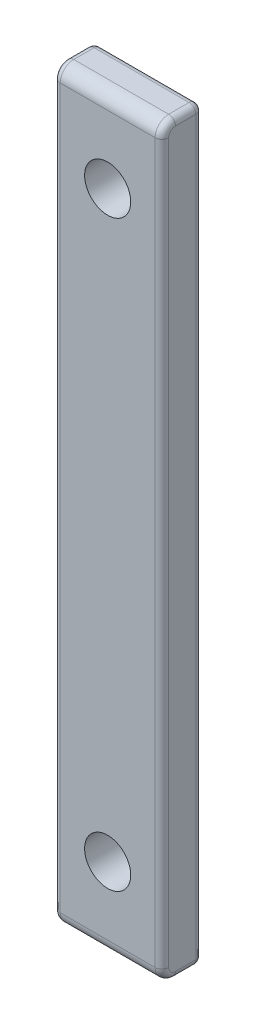
ISO-10303-21;
HEADER;
FILE_DESCRIPTION(('STEP AP214'),'2;1');
FILE_NAME('part.step','',(''),(''),'','','');
FILE_SCHEMA(('AUTOMOTIVE_DESIGN { 1 0 10303 214 1 1 1 1 }'));
ENDSEC;
DATA;
#1=APPLICATION_CONTEXT('core data for automotive mechanical design processes');
#2=APPLICATION_PROTOCOL_DEFINITION('international standard','automotive_design',2000,#1);
#3=PRODUCT_CONTEXT('',#1,'mechanical');
#4=PRODUCT('Part','Part','',(#3));
#5=PRODUCT_RELATED_PRODUCT_CATEGORY('part','',(#4));
#6=PRODUCT_DEFINITION_FORMATION('','',#4);
#7=PRODUCT_DEFINITION_CONTEXT('part definition',#1,'design');
#8=PRODUCT_DEFINITION('design','',#6,#7);
#9=PRODUCT_DEFINITION_SHAPE('','',#8);
#10=(LENGTH_UNIT() NAMED_UNIT(*) SI_UNIT(.MILLI.,.METRE.));
#11=(NAMED_UNIT(*) PLANE_ANGLE_UNIT() SI_UNIT($,.RADIAN.));
#12=(NAMED_UNIT(*) SI_UNIT($,.STERADIAN.) SOLID_ANGLE_UNIT());
#13=UNCERTAINTY_MEASURE_WITH_UNIT(LENGTH_MEASURE(1.E-05),#10,'distance_accuracy_value','');
#14=(GEOMETRIC_REPRESENTATION_CONTEXT(3) GLOBAL_UNCERTAINTY_ASSIGNED_CONTEXT((#13)) GLOBAL_UNIT_ASSIGNED_CONTEXT((#10,
#11,#12)) REPRESENTATION_CONTEXT('',''));
#15=CARTESIAN_POINT('',(0.,0.,0.));
#16=DIRECTION('',(0.,0.,1.));
#17=DIRECTION('',(1.,0.,0.));
#18=AXIS2_PLACEMENT_3D('',#15,#16,#17);
#19=CARTESIAN_POINT('',(-4.,-27.5,3.));
#20=DIRECTION('',(0.,1.,0.));
#21=DIRECTION('',(-1.,0.,0.));
#22=AXIS2_PLACEMENT_3D('',#19,#20,#21);
#23=PLANE('',#22);
#24=DIRECTION('',(0.,0.,-1.));
#25=VECTOR('',#24,1.);
#26=CARTESIAN_POINT('',(-3.5,-27.5,3.));
#27=LINE('',#26,#25);
#28=CARTESIAN_POINT('',(-3.5,-27.5,2.));
#29=VERTEX_POINT('',#28);
#30=CARTESIAN_POINT('',(-3.5,-27.5,0.5));
#31=VERTEX_POINT('',#30);
#32=EDGE_CURVE('E193',#29,#31,#27,.T.);
#33=ORIENTED_EDGE('',*,*,#32,.T.);
#34=DIRECTION('',(1.,0.,0.));
#35=VECTOR('',#34,1.);
#36=CARTESIAN_POINT('',(3.5,-27.5,0.5));
#37=LINE('',#36,#35);
#38=CARTESIAN_POINT('',(3.5,-27.5,0.5));
#39=VERTEX_POINT('',#38);
#40=EDGE_CURVE('E286',#31,#39,#37,.T.);
#41=ORIENTED_EDGE('',*,*,#40,.T.);
#42=DIRECTION('',(0.,0.,-1.));
#43=VECTOR('',#42,1.);
#44=CARTESIAN_POINT('',(3.5,-27.5,3.));
#45=LINE('',#44,#43);
#46=CARTESIAN_POINT('',(3.5,-27.5,2.));
#47=VERTEX_POINT('',#46);
#48=EDGE_CURVE('E197',#39,#47,#45,.F.);
#49=ORIENTED_EDGE('',*,*,#48,.T.);
#50=DIRECTION('',(1.,0.,0.));
#51=VECTOR('',#50,1.);
#52=CARTESIAN_POINT('',(-4.,-27.5,2.));
#53=LINE('',#52,#51);
#54=EDGE_CURVE('E181',#47,#29,#53,.F.);
#55=ORIENTED_EDGE('',*,*,#54,.T.);
#56=EDGE_LOOP('',(#33,#41,#49,#55));
#57=FACE_BOUND('',#56,.T.);
#58=ADVANCED_FACE('F46',(#57),#23,.F.);
#59=CARTESIAN_POINT('',(4.,27.5,3.));
#60=DIRECTION('',(-1.,0.,0.));
#61=DIRECTION('',(0.,-1.,0.));
#62=AXIS2_PLACEMENT_3D('',#59,#60,#61);
#63=PLANE('',#62);
#64=DIRECTION('',(0.,0.,-1.));
#65=VECTOR('',#64,1.);
#66=CARTESIAN_POINT('',(4.,-27.,3.));
#67=LINE('',#66,#65);
#68=CARTESIAN_POINT('',(4.,-27.,2.));
#69=VERTEX_POINT('',#68);
#70=CARTESIAN_POINT('',(4.,-27.,0.5));
#71=VERTEX_POINT('',#70);
#72=EDGE_CURVE('E190',#69,#71,#67,.T.);
#73=ORIENTED_EDGE('',*,*,#72,.T.);
#74=DIRECTION('',(0.,1.,0.));
#75=VECTOR('',#74,1.);
#76=CARTESIAN_POINT('',(4.,27.,0.5));
#77=LINE('',#76,#75);
#78=CARTESIAN_POINT('',(4.,27.,0.5));
#79=VERTEX_POINT('',#78);
#80=EDGE_CURVE('E267',#71,#79,#77,.T.);
#81=ORIENTED_EDGE('',*,*,#80,.T.);
#82=DIRECTION('',(0.,0.,-1.));
#83=VECTOR('',#82,1.);
#84=CARTESIAN_POINT('',(4.,27.,3.));
#85=LINE('',#84,#83);
#86=CARTESIAN_POINT('',(4.,27.,2.));
#87=VERTEX_POINT('',#86);
#88=EDGE_CURVE('E156',#79,#87,#85,.F.);
#89=ORIENTED_EDGE('',*,*,#88,.T.);
#90=CARTESIAN_POINT('',(4.,26.5,2.));
#91=DIRECTION('',(-1.,0.,0.));
#92=DIRECTION('',(0.,-1.,0.));
#93=AXIS2_PLACEMENT_3D('',#90,#91,#92);
#94=CIRCLE('',#93,0.5);
#95=CARTESIAN_POINT('',(4.,26.5,2.5));
#96=VERTEX_POINT('',#95);
#97=EDGE_CURVE('E148',#87,#96,#94,.F.);
#98=ORIENTED_EDGE('',*,*,#97,.T.);
#99=DIRECTION('',(0.,1.,0.));
#100=VECTOR('',#99,1.);
#101=CARTESIAN_POINT('',(4.,27.5,2.5));
#102=LINE('',#101,#100);
#103=CARTESIAN_POINT('',(4.,-26.5,2.5));
#104=VERTEX_POINT('',#103);
#105=EDGE_CURVE('E153',#96,#104,#102,.F.);
#106=ORIENTED_EDGE('',*,*,#105,.T.);
#107=CARTESIAN_POINT('',(4.,-26.5,2.));
#108=DIRECTION('',(-1.,0.,0.));
#109=DIRECTION('',(0.,-1.,0.));
#110=AXIS2_PLACEMENT_3D('',#107,#108,#109);
#111=CIRCLE('',#110,0.5);
#112=EDGE_CURVE('E187',#104,#69,#111,.F.);
#113=ORIENTED_EDGE('',*,*,#112,.T.);
#114=EDGE_LOOP('',(#73,#81,#89,#98,#106,#113));
#115=FACE_BOUND('',#114,.T.);
#116=ADVANCED_FACE('F151',(#115),#63,.F.);
#117=CARTESIAN_POINT('',(-4.,27.5,3.));
#118=DIRECTION('',(0.,-1.,0.));
#119=DIRECTION('',(0.,0.,-1.));
#120=AXIS2_PLACEMENT_3D('',#117,#118,#119);
#121=PLANE('',#120);
#122=DIRECTION('',(0.,0.,-1.));
#123=VECTOR('',#122,1.);
#124=CARTESIAN_POINT('',(3.5,27.5,3.));
#125=LINE('',#124,#123);
#126=CARTESIAN_POINT('',(3.5,27.5,2.));
#127=VERTEX_POINT('',#126);
#128=CARTESIAN_POINT('',(3.5,27.5,0.5));
#129=VERTEX_POINT('',#128);
#130=EDGE_CURVE('E209',#127,#129,#125,.T.);
#131=ORIENTED_EDGE('',*,*,#130,.T.);
#132=DIRECTION('',(-1.,0.,0.));
#133=VECTOR('',#132,1.);
#134=CARTESIAN_POINT('',(-3.5,27.5,0.5));
#135=LINE('',#134,#133);
#136=CARTESIAN_POINT('',(-3.5,27.5,0.5));
#137=VERTEX_POINT('',#136);
#138=EDGE_CURVE('E11',#129,#137,#135,.T.);
#139=ORIENTED_EDGE('',*,*,#138,.T.);
#140=DIRECTION('',(0.,0.,-1.));
#141=VECTOR('',#140,1.);
#142=CARTESIAN_POINT('',(-3.5,27.5,3.));
#143=LINE('',#142,#141);
#144=CARTESIAN_POINT('',(-3.5,27.5,2.));
#145=VERTEX_POINT('',#144);
#146=EDGE_CURVE('E206',#137,#145,#143,.F.);
#147=ORIENTED_EDGE('',*,*,#146,.T.);
#148=DIRECTION('',(-1.,0.,0.));
#149=VECTOR('',#148,1.);
#150=CARTESIAN_POINT('',(-4.,27.5,2.));
#151=LINE('',#150,#149);
#152=EDGE_CURVE('E177',#145,#127,#151,.F.);
#153=ORIENTED_EDGE('',*,*,#152,.T.);
#154=EDGE_LOOP('',(#131,#139,#147,#153));
#155=FACE_BOUND('',#154,.T.);
#156=ADVANCED_FACE('F416',(#155),#121,.F.);
#157=CARTESIAN_POINT('',(-4.,27.5,3.));
#158=DIRECTION('',(1.,0.,0.));
#159=DIRECTION('',(0.,1.,0.));
#160=AXIS2_PLACEMENT_3D('',#157,#158,#159);
#161=PLANE('',#160);
#162=DIRECTION('',(0.,0.,-1.));
#163=VECTOR('',#162,1.);
#164=CARTESIAN_POINT('',(-4.,27.,3.));
#165=LINE('',#164,#163);
#166=CARTESIAN_POINT('',(-4.,27.,2.));
#167=VERTEX_POINT('',#166);
#168=CARTESIAN_POINT('',(-4.,27.,0.5));
#169=VERTEX_POINT('',#168);
#170=EDGE_CURVE('E229',#167,#169,#165,.T.);
#171=ORIENTED_EDGE('',*,*,#170,.T.);
#172=DIRECTION('',(0.,-1.,0.));
#173=VECTOR('',#172,1.);
#174=CARTESIAN_POINT('',(-4.,-27.,0.5));
#175=LINE('',#174,#173);
#176=CARTESIAN_POINT('',(-4.,-27.,0.5));
#177=VERTEX_POINT('',#176);
#178=EDGE_CURVE('E292',#169,#177,#175,.T.);
#179=ORIENTED_EDGE('',*,*,#178,.T.);
#180=DIRECTION('',(0.,0.,-1.));
#181=VECTOR('',#180,1.);
#182=CARTESIAN_POINT('',(-4.,-27.,3.));
#183=LINE('',#182,#181);
#184=CARTESIAN_POINT('',(-4.,-27.,2.));
#185=VERTEX_POINT('',#184);
#186=EDGE_CURVE('E223',#177,#185,#183,.F.);
#187=ORIENTED_EDGE('',*,*,#186,.T.);
#188=CARTESIAN_POINT('',(-4.,-26.5,2.));
#189=DIRECTION('',(1.,0.,0.));
#190=DIRECTION('',(0.,1.,0.));
#191=AXIS2_PLACEMENT_3D('',#188,#189,#190);
#192=CIRCLE('',#191,0.5);
#193=CARTESIAN_POINT('',(-4.,-26.5,2.5));
#194=VERTEX_POINT('',#193);
#195=EDGE_CURVE('E220',#185,#194,#192,.F.);
#196=ORIENTED_EDGE('',*,*,#195,.T.);
#197=DIRECTION('',(0.,-1.,0.));
#198=VECTOR('',#197,1.);
#199=CARTESIAN_POINT('',(-4.,27.5,2.5));
#200=LINE('',#199,#198);
#201=CARTESIAN_POINT('',(-4.,26.5,2.5));
#202=VERTEX_POINT('',#201);
#203=EDGE_CURVE('E217',#194,#202,#200,.F.);
#204=ORIENTED_EDGE('',*,*,#203,.T.);
#205=CARTESIAN_POINT('',(-4.,26.5,2.));
#206=DIRECTION('',(1.,0.,0.));
#207=DIRECTION('',(0.,1.,0.));
#208=AXIS2_PLACEMENT_3D('',#205,#206,#207);
#209=CIRCLE('',#208,0.5);
#210=EDGE_CURVE('E226',#202,#167,#209,.F.);
#211=ORIENTED_EDGE('',*,*,#210,.T.);
#212=EDGE_LOOP('',(#171,#179,#187,#196,#204,#211));
#213=FACE_BOUND('',#212,.T.);
#214=ADVANCED_FACE('F386',(#213),#161,.F.);
#215=CARTESIAN_POINT('',(0.,0.,3.));
#216=DIRECTION('',(0.,0.,-1.));
#217=DIRECTION('',(-1.,0.,0.));
#218=AXIS2_PLACEMENT_3D('',#215,#216,#217);
#219=PLANE('',#218);
#220=CARTESIAN_POINT('',(0.,21.5,3.));
#221=DIRECTION('',(0.,0.,1.));
#222=DIRECTION('',(1.,0.,0.));
#223=AXIS2_PLACEMENT_3D('',#220,#221,#222);
#224=CIRCLE('',#223,1.7);
#225=CARTESIAN_POINT('',(1.7,21.5,3.));
#226=VERTEX_POINT('',#225);
#227=EDGE_CURVE('E364',#226,#226,#224,.T.);
#228=ORIENTED_EDGE('',*,*,#227,.F.);
#229=EDGE_LOOP('',(#228));
#230=FACE_BOUND('',#229,.T.);
#231=CARTESIAN_POINT('',(0.,-21.5,3.));
#232=DIRECTION('',(0.,0.,1.));
#233=DIRECTION('',(-1.,0.,0.));
#234=AXIS2_PLACEMENT_3D('',#231,#232,#233);
#235=CIRCLE('',#234,1.7);
#236=CARTESIAN_POINT('',(-1.7,-21.5,3.));
#237=VERTEX_POINT('',#236);
#238=EDGE_CURVE('E360',#237,#237,#235,.T.);
#239=ORIENTED_EDGE('',*,*,#238,.F.);
#240=EDGE_LOOP('',(#239));
#241=FACE_BOUND('',#240,.T.);
#242=DIRECTION('',(1.,0.,0.));
#243=VECTOR('',#242,1.);
#244=CARTESIAN_POINT('',(0.,-26.5,3.));
#245=LINE('',#244,#243);
#246=CARTESIAN_POINT('',(-3.5,-26.5,3.));
#247=VERTEX_POINT('',#246);
#248=CARTESIAN_POINT('',(3.5,-26.5,3.));
#249=VERTEX_POINT('',#248);
#250=EDGE_CURVE('E347',#247,#249,#245,.T.);
#251=ORIENTED_EDGE('',*,*,#250,.T.);
#252=DIRECTION('',(0.,1.,0.));
#253=VECTOR('',#252,1.);
#254=CARTESIAN_POINT('',(3.5,0.,3.));
#255=LINE('',#254,#253);
#256=CARTESIAN_POINT('',(3.5,26.5,3.));
#257=VERTEX_POINT('',#256);
#258=EDGE_CURVE('E235',#249,#257,#255,.T.);
#259=ORIENTED_EDGE('',*,*,#258,.T.);
#260=DIRECTION('',(-1.,0.,0.));
#261=VECTOR('',#260,1.);
#262=CARTESIAN_POINT('',(0.,26.5,3.));
#263=LINE('',#262,#261);
#264=CARTESIAN_POINT('',(-3.5,26.5,3.));
#265=VERTEX_POINT('',#264);
#266=EDGE_CURVE('E350',#257,#265,#263,.T.);
#267=ORIENTED_EDGE('',*,*,#266,.T.);
#268=DIRECTION('',(0.,-1.,0.));
#269=VECTOR('',#268,1.);
#270=CARTESIAN_POINT('',(-3.5,0.,3.));
#271=LINE('',#270,#269);
#272=EDGE_CURVE('E232',#265,#247,#271,.T.);
#273=ORIENTED_EDGE('',*,*,#272,.T.);
#274=EDGE_LOOP('',(#251,#259,#267,#273));
#275=FACE_BOUND('',#274,.T.);
#276=ADVANCED_FACE('F383',(#230,#241,#275),#219,.F.);
#277=CARTESIAN_POINT('',(0.,0.,0.));
#278=DIRECTION('',(0.,0.,-1.));
#279=DIRECTION('',(-1.,0.,0.));
#280=AXIS2_PLACEMENT_3D('',#277,#278,#279);
#281=PLANE('',#280);
#282=DIRECTION('',(-1.,0.,0.));
#283=VECTOR('',#282,1.);
#284=CARTESIAN_POINT('',(3.5,27.,0.));
#285=LINE('',#284,#283);
#286=CARTESIAN_POINT('',(-3.5,27.,0.));
#287=VERTEX_POINT('',#286);
#288=CARTESIAN_POINT('',(3.5,27.,0.));
#289=VERTEX_POINT('',#288);
#290=EDGE_CURVE('E270',#287,#289,#285,.F.);
#291=ORIENTED_EDGE('',*,*,#290,.T.);
#292=DIRECTION('',(0.,1.,0.));
#293=VECTOR('',#292,1.);
#294=CARTESIAN_POINT('',(3.5,-27.,0.));
#295=LINE('',#294,#293);
#296=CARTESIAN_POINT('',(3.5,-27.,0.));
#297=VERTEX_POINT('',#296);
#298=EDGE_CURVE('E279',#289,#297,#295,.F.);
#299=ORIENTED_EDGE('',*,*,#298,.T.);
#300=DIRECTION('',(1.,0.,0.));
#301=VECTOR('',#300,1.);
#302=CARTESIAN_POINT('',(-3.5,-27.,0.));
#303=LINE('',#302,#301);
#304=CARTESIAN_POINT('',(-3.5,-27.,0.));
#305=VERTEX_POINT('',#304);
#306=EDGE_CURVE('E276',#297,#305,#303,.F.);
#307=ORIENTED_EDGE('',*,*,#306,.T.);
#308=DIRECTION('',(0.,-1.,0.));
#309=VECTOR('',#308,1.);
#310=CARTESIAN_POINT('',(-3.5,27.,0.));
#311=LINE('',#310,#309);
#312=EDGE_CURVE('E273',#305,#287,#311,.F.);
#313=ORIENTED_EDGE('',*,*,#312,.T.);
#314=EDGE_LOOP('',(#291,#299,#307,#313));
#315=FACE_BOUND('',#314,.T.);
#316=CARTESIAN_POINT('',(0.,21.5,0.));
#317=DIRECTION('',(0.,0.,1.));
#318=DIRECTION('',(1.,0.,0.));
#319=AXIS2_PLACEMENT_3D('',#316,#317,#318);
#320=CIRCLE('',#319,1.7);
#321=CARTESIAN_POINT('',(1.7,21.5,0.));
#322=VERTEX_POINT('',#321);
#323=EDGE_CURVE('E356',#322,#322,#320,.T.);
#324=ORIENTED_EDGE('',*,*,#323,.T.);
#325=EDGE_LOOP('',(#324));
#326=FACE_BOUND('',#325,.T.);
#327=CARTESIAN_POINT('',(0.,-21.5,0.));
#328=DIRECTION('',(0.,0.,1.));
#329=DIRECTION('',(-1.,0.,0.));
#330=AXIS2_PLACEMENT_3D('',#327,#328,#329);
#331=CIRCLE('',#330,1.7);
#332=CARTESIAN_POINT('',(-1.7,-21.5,0.));
#333=VERTEX_POINT('',#332);
#334=EDGE_CURVE('E248',#333,#333,#331,.T.);
#335=ORIENTED_EDGE('',*,*,#334,.T.);
#336=EDGE_LOOP('',(#335));
#337=FACE_BOUND('',#336,.T.);
#338=ADVANCED_FACE('F372',(#315,#326,#337),#281,.T.);
#339=CARTESIAN_POINT('',(0.,-21.5,0.));
#340=DIRECTION('',(0.,0.,1.));
#341=DIRECTION('',(1.,0.,0.));
#342=AXIS2_PLACEMENT_3D('',#339,#340,#341);
#343=CYLINDRICAL_SURFACE('',#342,1.7);
#344=ORIENTED_EDGE('',*,*,#334,.F.);
#345=EDGE_LOOP('',(#344));
#346=FACE_BOUND('',#345,.T.);
#347=ORIENTED_EDGE('',*,*,#238,.T.);
#348=EDGE_LOOP('',(#347));
#349=FACE_BOUND('',#348,.T.);
#350=ADVANCED_FACE('F379',(#346,#349),#343,.F.);
#351=CARTESIAN_POINT('',(0.,21.5,0.));
#352=DIRECTION('',(0.,0.,1.));
#353=DIRECTION('',(1.,0.,0.));
#354=AXIS2_PLACEMENT_3D('',#351,#352,#353);
#355=CYLINDRICAL_SURFACE('',#354,1.7);
#356=ORIENTED_EDGE('',*,*,#323,.F.);
#357=EDGE_LOOP('',(#356));
#358=FACE_BOUND('',#357,.T.);
#359=ORIENTED_EDGE('',*,*,#227,.T.);
#360=EDGE_LOOP('',(#359));
#361=FACE_BOUND('',#360,.T.);
#362=ADVANCED_FACE('F375',(#358,#361),#355,.F.);
#363=CARTESIAN_POINT('',(0.,-26.5,2.));
#364=DIRECTION('',(1.,0.,0.));
#365=DIRECTION('',(0.,1.,0.));
#366=AXIS2_PLACEMENT_3D('',#363,#364,#365);
#367=CYLINDRICAL_SURFACE('',#366,1.);
#368=ORIENTED_EDGE('',*,*,#54,.F.);
#369=CARTESIAN_POINT('',(3.5,-26.5,2.));
#370=DIRECTION('',(-1.,0.,0.));
#371=DIRECTION('',(0.,-1.,0.));
#372=AXIS2_PLACEMENT_3D('',#369,#370,#371);
#373=CIRCLE('',#372,1.);
#374=EDGE_CURVE('E203',#47,#249,#373,.T.);
#375=ORIENTED_EDGE('',*,*,#374,.T.);
#376=ORIENTED_EDGE('',*,*,#250,.F.);
#377=CARTESIAN_POINT('',(-3.5,-26.5,2.));
#378=DIRECTION('',(1.,0.,0.));
#379=DIRECTION('',(0.,1.,0.));
#380=AXIS2_PLACEMENT_3D('',#377,#378,#379);
#381=CIRCLE('',#380,1.);
#382=EDGE_CURVE('E200',#247,#29,#381,.T.);
#383=ORIENTED_EDGE('',*,*,#382,.T.);
#384=EDGE_LOOP('',(#368,#375,#376,#383));
#385=FACE_BOUND('',#384,.T.);
#386=ADVANCED_FACE('F378',(#385),#367,.T.);
#387=CARTESIAN_POINT('',(0.,26.5,2.));
#388=DIRECTION('',(-1.,0.,0.));
#389=DIRECTION('',(0.,0.,1.));
#390=AXIS2_PLACEMENT_3D('',#387,#388,#389);
#391=CYLINDRICAL_SURFACE('',#390,1.);
#392=ORIENTED_EDGE('',*,*,#266,.F.);
#393=CARTESIAN_POINT('',(3.5,26.5,2.));
#394=DIRECTION('',(-1.,0.,0.));
#395=DIRECTION('',(0.,-1.,0.));
#396=AXIS2_PLACEMENT_3D('',#393,#394,#395);
#397=CIRCLE('',#396,1.);
#398=EDGE_CURVE('E166',#257,#127,#397,.T.);
#399=ORIENTED_EDGE('',*,*,#398,.T.);
#400=ORIENTED_EDGE('',*,*,#152,.F.);
#401=CARTESIAN_POINT('',(-3.5,26.5,2.));
#402=DIRECTION('',(1.,0.,0.));
#403=DIRECTION('',(0.,1.,0.));
#404=AXIS2_PLACEMENT_3D('',#401,#402,#403);
#405=CIRCLE('',#404,1.);
#406=EDGE_CURVE('E212',#145,#265,#405,.T.);
#407=ORIENTED_EDGE('',*,*,#406,.T.);
#408=EDGE_LOOP('',(#392,#399,#400,#407));
#409=FACE_BOUND('',#408,.T.);
#410=ADVANCED_FACE('F420',(#409),#391,.T.);
#411=CARTESIAN_POINT('',(3.5,27.,3.));
#412=DIRECTION('',(0.,0.,-1.));
#413=DIRECTION('',(-1.,0.,0.));
#414=AXIS2_PLACEMENT_3D('',#411,#412,#413);
#415=CYLINDRICAL_SURFACE('',#414,0.5);
#416=ORIENTED_EDGE('',*,*,#88,.F.);
#417=CARTESIAN_POINT('',(3.5,27.,0.5));
#418=DIRECTION('',(0.,0.,-1.));
#419=DIRECTION('',(-1.,0.,0.));
#420=AXIS2_PLACEMENT_3D('',#417,#418,#419);
#421=CIRCLE('',#420,0.5);
#422=EDGE_CURVE('E238',#79,#129,#421,.F.);
#423=ORIENTED_EDGE('',*,*,#422,.T.);
#424=ORIENTED_EDGE('',*,*,#130,.F.);
#425=CARTESIAN_POINT('',(3.5,27.,2.));
#426=DIRECTION('',(0.,0.,1.));
#427=DIRECTION('',(1.,0.,0.));
#428=AXIS2_PLACEMENT_3D('',#425,#426,#427);
#429=CIRCLE('',#428,0.5);
#430=EDGE_CURVE('E170',#87,#127,#429,.T.);
#431=ORIENTED_EDGE('',*,*,#430,.F.);
#432=EDGE_LOOP('',(#416,#423,#424,#431));
#433=FACE_BOUND('',#432,.T.);
#434=ADVANCED_FACE('F415',(#433),#415,.T.);
#435=CARTESIAN_POINT('',(3.5,26.5,2.));
#436=DIRECTION('',(-1.,0.,0.));
#437=DIRECTION('',(0.,-1.,0.));
#438=AXIS2_PLACEMENT_3D('',#435,#436,#437);
#439=DEGENERATE_TOROIDAL_SURFACE('',#438,0.5,0.5,.T.);
#440=ORIENTED_EDGE('',*,*,#430,.T.);
#441=ORIENTED_EDGE('',*,*,#398,.F.);
#442=CARTESIAN_POINT('',(3.5,26.5,2.5));
#443=DIRECTION('',(0.,-1.,0.));
#444=DIRECTION('',(0.,0.,-1.));
#445=AXIS2_PLACEMENT_3D('',#442,#443,#444);
#446=CIRCLE('',#445,0.5);
#447=EDGE_CURVE('E164',#96,#257,#446,.T.);
#448=ORIENTED_EDGE('',*,*,#447,.F.);
#449=ORIENTED_EDGE('',*,*,#97,.F.);
#450=EDGE_LOOP('',(#440,#441,#448,#449));
#451=FACE_BOUND('',#450,.T.);
#452=ADVANCED_FACE('F165',(#451),#439,.T.);
#453=CARTESIAN_POINT('',(3.5,0.,2.5));
#454=DIRECTION('',(0.,1.,0.));
#455=DIRECTION('',(-1.,0.,0.));
#456=AXIS2_PLACEMENT_3D('',#453,#454,#455);
#457=CYLINDRICAL_SURFACE('',#456,0.5);
#458=ORIENTED_EDGE('',*,*,#447,.T.);
#459=ORIENTED_EDGE('',*,*,#258,.F.);
#460=CARTESIAN_POINT('',(3.5,-26.5,2.5));
#461=DIRECTION('',(0.,-1.,0.));
#462=DIRECTION('',(0.,0.,-1.));
#463=AXIS2_PLACEMENT_3D('',#460,#461,#462);
#464=CIRCLE('',#463,0.5);
#465=EDGE_CURVE('E171',#104,#249,#464,.T.);
#466=ORIENTED_EDGE('',*,*,#465,.F.);
#467=ORIENTED_EDGE('',*,*,#105,.F.);
#468=EDGE_LOOP('',(#458,#459,#466,#467));
#469=FACE_BOUND('',#468,.T.);
#470=ADVANCED_FACE('F173',(#469),#457,.T.);
#471=CARTESIAN_POINT('',(3.5,-26.5,2.));
#472=DIRECTION('',(-1.,0.,0.));
#473=DIRECTION('',(0.,-1.,0.));
#474=AXIS2_PLACEMENT_3D('',#471,#472,#473);
#475=DEGENERATE_TOROIDAL_SURFACE('',#474,0.5,0.5,.T.);
#476=ORIENTED_EDGE('',*,*,#465,.T.);
#477=ORIENTED_EDGE('',*,*,#374,.F.);
#478=CARTESIAN_POINT('',(3.5,-27.,2.));
#479=DIRECTION('',(0.,0.,-1.));
#480=DIRECTION('',(-1.,0.,0.));
#481=AXIS2_PLACEMENT_3D('',#478,#479,#480);
#482=CIRCLE('',#481,0.5);
#483=EDGE_CURVE('E239',#69,#47,#482,.T.);
#484=ORIENTED_EDGE('',*,*,#483,.F.);
#485=ORIENTED_EDGE('',*,*,#112,.F.);
#486=EDGE_LOOP('',(#476,#477,#484,#485));
#487=FACE_BOUND('',#486,.T.);
#488=ADVANCED_FACE('F395',(#487),#475,.T.);
#489=CARTESIAN_POINT('',(3.5,-27.,3.));
#490=DIRECTION('',(0.,0.,-1.));
#491=DIRECTION('',(-1.,0.,0.));
#492=AXIS2_PLACEMENT_3D('',#489,#490,#491);
#493=CYLINDRICAL_SURFACE('',#492,0.5);
#494=ORIENTED_EDGE('',*,*,#48,.F.);
#495=CARTESIAN_POINT('',(3.5,-27.,0.5));
#496=DIRECTION('',(0.,0.,-1.));
#497=DIRECTION('',(-1.,0.,0.));
#498=AXIS2_PLACEMENT_3D('',#495,#496,#497);
#499=CIRCLE('',#498,0.5);
#500=EDGE_CURVE('E283',#39,#71,#499,.F.);
#501=ORIENTED_EDGE('',*,*,#500,.T.);
#502=ORIENTED_EDGE('',*,*,#72,.F.);
#503=ORIENTED_EDGE('',*,*,#483,.T.);
#504=EDGE_LOOP('',(#494,#501,#502,#503));
#505=FACE_BOUND('',#504,.T.);
#506=ADVANCED_FACE('F498',(#505),#493,.T.);
#507=CARTESIAN_POINT('',(-3.5,-27.,3.));
#508=DIRECTION('',(0.,0.,-1.));
#509=DIRECTION('',(-1.,0.,0.));
#510=AXIS2_PLACEMENT_3D('',#507,#508,#509);
#511=CYLINDRICAL_SURFACE('',#510,0.5);
#512=ORIENTED_EDGE('',*,*,#186,.F.);
#513=CARTESIAN_POINT('',(-3.5,-27.,0.5));
#514=DIRECTION('',(0.,0.,-1.));
#515=DIRECTION('',(-1.,0.,0.));
#516=AXIS2_PLACEMENT_3D('',#513,#514,#515);
#517=CIRCLE('',#516,0.5);
#518=EDGE_CURVE('E289',#177,#31,#517,.F.);
#519=ORIENTED_EDGE('',*,*,#518,.T.);
#520=ORIENTED_EDGE('',*,*,#32,.F.);
#521=CARTESIAN_POINT('',(-3.5,-27.,2.));
#522=DIRECTION('',(0.,0.,1.));
#523=DIRECTION('',(1.,0.,0.));
#524=AXIS2_PLACEMENT_3D('',#521,#522,#523);
#525=CIRCLE('',#524,0.5);
#526=EDGE_CURVE('E243',#185,#29,#525,.T.);
#527=ORIENTED_EDGE('',*,*,#526,.F.);
#528=EDGE_LOOP('',(#512,#519,#520,#527));
#529=FACE_BOUND('',#528,.T.);
#530=ADVANCED_FACE('F338',(#529),#511,.T.);
#531=CARTESIAN_POINT('',(-3.5,-26.5,2.));
#532=DIRECTION('',(1.,0.,0.));
#533=DIRECTION('',(0.,1.,0.));
#534=AXIS2_PLACEMENT_3D('',#531,#532,#533);
#535=DEGENERATE_TOROIDAL_SURFACE('',#534,0.5,0.5,.T.);
#536=ORIENTED_EDGE('',*,*,#526,.T.);
#537=ORIENTED_EDGE('',*,*,#382,.F.);
#538=CARTESIAN_POINT('',(-3.5,-26.5,2.5));
#539=DIRECTION('',(0.,1.,0.));
#540=DIRECTION('',(0.,0.,1.));
#541=AXIS2_PLACEMENT_3D('',#538,#539,#540);
#542=CIRCLE('',#541,0.5);
#543=EDGE_CURVE('E257',#194,#247,#542,.T.);
#544=ORIENTED_EDGE('',*,*,#543,.F.);
#545=ORIENTED_EDGE('',*,*,#195,.F.);
#546=EDGE_LOOP('',(#536,#537,#544,#545));
#547=FACE_BOUND('',#546,.T.);
#548=ADVANCED_FACE('F434',(#547),#535,.T.);
#549=CARTESIAN_POINT('',(-3.5,0.,2.5));
#550=DIRECTION('',(0.,-1.,0.));
#551=DIRECTION('',(1.,0.,0.));
#552=AXIS2_PLACEMENT_3D('',#549,#550,#551);
#553=CYLINDRICAL_SURFACE('',#552,0.5);
#554=ORIENTED_EDGE('',*,*,#543,.T.);
#555=ORIENTED_EDGE('',*,*,#272,.F.);
#556=CARTESIAN_POINT('',(-3.5,26.5,2.5));
#557=DIRECTION('',(0.,1.,0.));
#558=DIRECTION('',(0.,0.,1.));
#559=AXIS2_PLACEMENT_3D('',#556,#557,#558);
#560=CIRCLE('',#559,0.5);
#561=EDGE_CURVE('E253',#202,#265,#560,.T.);
#562=ORIENTED_EDGE('',*,*,#561,.F.);
#563=ORIENTED_EDGE('',*,*,#203,.F.);
#564=EDGE_LOOP('',(#554,#555,#562,#563));
#565=FACE_BOUND('',#564,.T.);
#566=ADVANCED_FACE('F432',(#565),#553,.T.);
#567=CARTESIAN_POINT('',(-3.5,26.5,2.));
#568=DIRECTION('',(1.,0.,0.));
#569=DIRECTION('',(0.,1.,0.));
#570=AXIS2_PLACEMENT_3D('',#567,#568,#569);
#571=DEGENERATE_TOROIDAL_SURFACE('',#570,0.5,0.5,.T.);
#572=ORIENTED_EDGE('',*,*,#561,.T.);
#573=ORIENTED_EDGE('',*,*,#406,.F.);
#574=CARTESIAN_POINT('',(-3.5,27.,2.));
#575=DIRECTION('',(0.,0.,-1.));
#576=DIRECTION('',(-1.,0.,0.));
#577=AXIS2_PLACEMENT_3D('',#574,#575,#576);
#578=CIRCLE('',#577,0.5);
#579=EDGE_CURVE('E249',#167,#145,#578,.T.);
#580=ORIENTED_EDGE('',*,*,#579,.F.);
#581=ORIENTED_EDGE('',*,*,#210,.F.);
#582=EDGE_LOOP('',(#572,#573,#580,#581));
#583=FACE_BOUND('',#582,.T.);
#584=ADVANCED_FACE('F423',(#583),#571,.T.);
#585=CARTESIAN_POINT('',(-3.5,27.,3.));
#586=DIRECTION('',(0.,0.,-1.));
#587=DIRECTION('',(-1.,0.,0.));
#588=AXIS2_PLACEMENT_3D('',#585,#586,#587);
#589=CYLINDRICAL_SURFACE('',#588,0.5);
#590=ORIENTED_EDGE('',*,*,#146,.F.);
#591=CARTESIAN_POINT('',(-3.5,27.,0.5));
#592=DIRECTION('',(0.,0.,-1.));
#593=DIRECTION('',(-1.,0.,0.));
#594=AXIS2_PLACEMENT_3D('',#591,#592,#593);
#595=CIRCLE('',#594,0.5);
#596=EDGE_CURVE('E56',#137,#169,#595,.F.);
#597=ORIENTED_EDGE('',*,*,#596,.T.);
#598=ORIENTED_EDGE('',*,*,#170,.F.);
#599=ORIENTED_EDGE('',*,*,#579,.T.);
#600=EDGE_LOOP('',(#590,#597,#598,#599));
#601=FACE_BOUND('',#600,.T.);
#602=ADVANCED_FACE('F426',(#601),#589,.T.);
#603=CARTESIAN_POINT('',(-3.5,-27.,0.5));
#604=DIRECTION('',(0.,0.,-1.));
#605=DIRECTION('',(-1.,0.,0.));
#606=AXIS2_PLACEMENT_3D('',#603,#604,#605);
#607=SPHERICAL_SURFACE('',#606,0.5);
#608=CARTESIAN_POINT('',(-3.5,-27.,0.5));
#609=DIRECTION('',(1.,0.,0.));
#610=DIRECTION('',(0.,1.,0.));
#611=AXIS2_PLACEMENT_3D('',#608,#609,#610);
#612=CIRCLE('',#611,0.5);
#613=EDGE_CURVE('E318',#31,#305,#612,.T.);
#614=ORIENTED_EDGE('',*,*,#613,.F.);
#615=ORIENTED_EDGE('',*,*,#518,.F.);
#616=CARTESIAN_POINT('',(-3.5,-27.,0.5));
#617=DIRECTION('',(0.,1.,0.));
#618=DIRECTION('',(0.,0.,1.));
#619=AXIS2_PLACEMENT_3D('',#616,#617,#618);
#620=CIRCLE('',#619,0.5);
#621=EDGE_CURVE('E50',#305,#177,#620,.T.);
#622=ORIENTED_EDGE('',*,*,#621,.F.);
#623=EDGE_LOOP('',(#614,#615,#622));
#624=FACE_BOUND('',#623,.T.);
#625=ADVANCED_FACE('F48',(#624),#607,.T.);
#626=CARTESIAN_POINT('',(-3.5,27.5,0.5));
#627=DIRECTION('',(0.,1.,0.));
#628=DIRECTION('',(-1.,0.,0.));
#629=AXIS2_PLACEMENT_3D('',#626,#627,#628);
#630=CYLINDRICAL_SURFACE('',#629,0.5);
#631=ORIENTED_EDGE('',*,*,#621,.T.);
#632=ORIENTED_EDGE('',*,*,#178,.F.);
#633=CARTESIAN_POINT('',(-3.5,27.,0.5));
#634=DIRECTION('',(0.,1.,0.));
#635=DIRECTION('',(0.,0.,1.));
#636=AXIS2_PLACEMENT_3D('',#633,#634,#635);
#637=CIRCLE('',#636,0.5);
#638=EDGE_CURVE('E315',#287,#169,#637,.T.);
#639=ORIENTED_EDGE('',*,*,#638,.F.);
#640=ORIENTED_EDGE('',*,*,#312,.F.);
#641=EDGE_LOOP('',(#631,#632,#639,#640));
#642=FACE_BOUND('',#641,.T.);
#643=ADVANCED_FACE('F331',(#642),#630,.T.);
#644=CARTESIAN_POINT('',(-4.,-27.,0.5));
#645=DIRECTION('',(-1.,0.,0.));
#646=DIRECTION('',(0.,-1.,0.));
#647=AXIS2_PLACEMENT_3D('',#644,#645,#646);
#648=CYLINDRICAL_SURFACE('',#647,0.5);
#649=ORIENTED_EDGE('',*,*,#613,.T.);
#650=ORIENTED_EDGE('',*,*,#306,.F.);
#651=CARTESIAN_POINT('',(3.5,-27.,0.5));
#652=DIRECTION('',(1.,0.,0.));
#653=DIRECTION('',(0.,0.,-1.));
#654=AXIS2_PLACEMENT_3D('',#651,#652,#653);
#655=CIRCLE('',#654,0.5);
#656=EDGE_CURVE('E311',#39,#297,#655,.T.);
#657=ORIENTED_EDGE('',*,*,#656,.F.);
#658=ORIENTED_EDGE('',*,*,#40,.F.);
#659=EDGE_LOOP('',(#649,#650,#657,#658));
#660=FACE_BOUND('',#659,.T.);
#661=ADVANCED_FACE('F532',(#660),#648,.T.);
#662=CARTESIAN_POINT('',(-3.5,27.,0.5));
#663=DIRECTION('',(0.,0.,-1.));
#664=DIRECTION('',(-1.,0.,0.));
#665=AXIS2_PLACEMENT_3D('',#662,#663,#664);
#666=SPHERICAL_SURFACE('',#665,0.5);
#667=ORIENTED_EDGE('',*,*,#638,.T.);
#668=ORIENTED_EDGE('',*,*,#596,.F.);
#669=CARTESIAN_POINT('',(-3.5,27.,0.5));
#670=DIRECTION('',(1.,0.,0.));
#671=DIRECTION('',(0.,0.,-1.));
#672=AXIS2_PLACEMENT_3D('',#669,#670,#671);
#673=CIRCLE('',#672,0.5);
#674=EDGE_CURVE('E307',#287,#137,#673,.T.);
#675=ORIENTED_EDGE('',*,*,#674,.F.);
#676=EDGE_LOOP('',(#667,#668,#675));
#677=FACE_BOUND('',#676,.T.);
#678=ADVANCED_FACE('F539',(#677),#666,.T.);
#679=CARTESIAN_POINT('',(3.5,-27.,0.5));
#680=DIRECTION('',(0.,0.,-1.));
#681=DIRECTION('',(-1.,0.,0.));
#682=AXIS2_PLACEMENT_3D('',#679,#680,#681);
#683=SPHERICAL_SURFACE('',#682,0.5);
#684=ORIENTED_EDGE('',*,*,#500,.F.);
#685=ORIENTED_EDGE('',*,*,#656,.T.);
#686=CARTESIAN_POINT('',(3.5,-27.,0.5));
#687=DIRECTION('',(0.,1.,0.));
#688=DIRECTION('',(0.,0.,1.));
#689=AXIS2_PLACEMENT_3D('',#686,#687,#688);
#690=CIRCLE('',#689,0.5);
#691=EDGE_CURVE('E304',#71,#297,#690,.T.);
#692=ORIENTED_EDGE('',*,*,#691,.F.);
#693=EDGE_LOOP('',(#684,#685,#692));
#694=FACE_BOUND('',#693,.T.);
#695=ADVANCED_FACE('F403',(#694),#683,.T.);
#696=CARTESIAN_POINT('',(-4.,27.,0.5));
#697=DIRECTION('',(1.,0.,0.));
#698=DIRECTION('',(0.,0.,-1.));
#699=AXIS2_PLACEMENT_3D('',#696,#697,#698);
#700=CYLINDRICAL_SURFACE('',#699,0.5);
#701=ORIENTED_EDGE('',*,*,#674,.T.);
#702=ORIENTED_EDGE('',*,*,#138,.F.);
#703=CARTESIAN_POINT('',(3.5,27.,0.5));
#704=DIRECTION('',(1.,0.,0.));
#705=DIRECTION('',(0.,0.,-1.));
#706=AXIS2_PLACEMENT_3D('',#703,#704,#705);
#707=CIRCLE('',#706,0.5);
#708=EDGE_CURVE('E301',#289,#129,#707,.T.);
#709=ORIENTED_EDGE('',*,*,#708,.F.);
#710=ORIENTED_EDGE('',*,*,#290,.F.);
#711=EDGE_LOOP('',(#701,#702,#709,#710));
#712=FACE_BOUND('',#711,.T.);
#713=ADVANCED_FACE('F555',(#712),#700,.T.);
#714=CARTESIAN_POINT('',(3.5,27.5,0.5));
#715=DIRECTION('',(0.,-1.,0.));
#716=DIRECTION('',(1.,0.,0.));
#717=AXIS2_PLACEMENT_3D('',#714,#715,#716);
#718=CYLINDRICAL_SURFACE('',#717,0.5);
#719=ORIENTED_EDGE('',*,*,#691,.T.);
#720=ORIENTED_EDGE('',*,*,#298,.F.);
#721=CARTESIAN_POINT('',(3.5,27.,0.5));
#722=DIRECTION('',(0.,1.,0.));
#723=DIRECTION('',(0.,0.,1.));
#724=AXIS2_PLACEMENT_3D('',#721,#722,#723);
#725=CIRCLE('',#724,0.5);
#726=EDGE_CURVE('E297',#79,#289,#725,.T.);
#727=ORIENTED_EDGE('',*,*,#726,.F.);
#728=ORIENTED_EDGE('',*,*,#80,.F.);
#729=EDGE_LOOP('',(#719,#720,#727,#728));
#730=FACE_BOUND('',#729,.T.);
#731=ADVANCED_FACE('F408',(#730),#718,.T.);
#732=CARTESIAN_POINT('',(3.5,27.,0.5));
#733=DIRECTION('',(0.,0.,-1.));
#734=DIRECTION('',(-1.,0.,0.));
#735=AXIS2_PLACEMENT_3D('',#732,#733,#734);
#736=SPHERICAL_SURFACE('',#735,0.5);
#737=ORIENTED_EDGE('',*,*,#708,.T.);
#738=ORIENTED_EDGE('',*,*,#422,.F.);
#739=ORIENTED_EDGE('',*,*,#726,.T.);
#740=EDGE_LOOP('',(#737,#738,#739));
#741=FACE_BOUND('',#740,.T.);
#742=ADVANCED_FACE('F412',(#741),#736,.T.);
#743=CLOSED_SHELL('',(#58,#116,#156,#214,#276,#338,#350,#362,#386,#410,#434,#452,#470,#488,#506,
#530,#548,#566,#584,#602,#625,#643,#661,#678,#695,#713,#731,#742));
#744=MANIFOLD_SOLID_BREP('B2',#743);
#745=ADVANCED_BREP_SHAPE_REPRESENTATION('',(#18,#744),#14);
#746=SHAPE_DEFINITION_REPRESENTATION(#9,#745);
ENDSEC;
END-ISO-10303-21;
